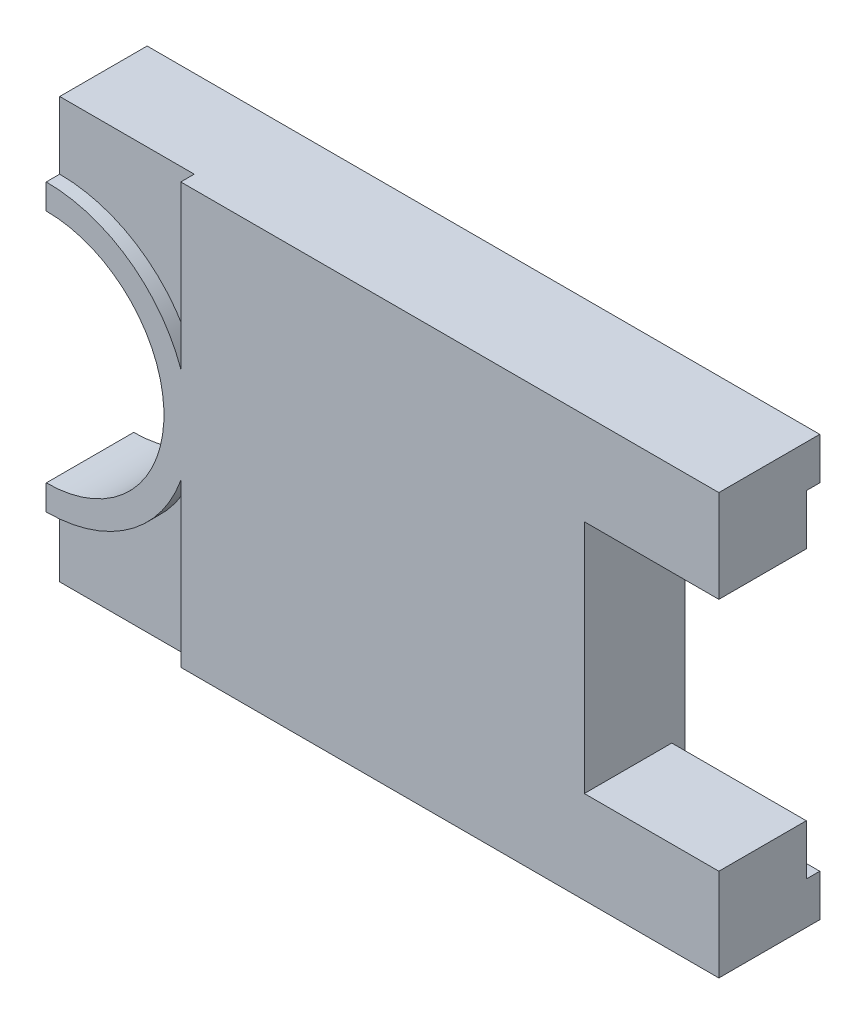
ISO-10303-21;
HEADER;
FILE_DESCRIPTION(('STEP AP214'),'2;1');
FILE_NAME('part.step','',(''),(''),'','','');
FILE_SCHEMA(('AUTOMOTIVE_DESIGN { 1 0 10303 214 1 1 1 1 }'));
ENDSEC;
DATA;
#1=APPLICATION_CONTEXT('core data for automotive mechanical design processes');
#2=APPLICATION_PROTOCOL_DEFINITION('international standard','automotive_design',2000,#1);
#3=PRODUCT_CONTEXT('',#1,'mechanical');
#4=PRODUCT('Part','Part','',(#3));
#5=PRODUCT_RELATED_PRODUCT_CATEGORY('part','',(#4));
#6=PRODUCT_DEFINITION_FORMATION('','',#4);
#7=PRODUCT_DEFINITION_CONTEXT('part definition',#1,'design');
#8=PRODUCT_DEFINITION('design','',#6,#7);
#9=PRODUCT_DEFINITION_SHAPE('','',#8);
#10=(LENGTH_UNIT() NAMED_UNIT(*) SI_UNIT(.MILLI.,.METRE.));
#11=(NAMED_UNIT(*) PLANE_ANGLE_UNIT() SI_UNIT($,.RADIAN.));
#12=(NAMED_UNIT(*) SI_UNIT($,.STERADIAN.) SOLID_ANGLE_UNIT());
#13=UNCERTAINTY_MEASURE_WITH_UNIT(LENGTH_MEASURE(1.E-05),#10,'distance_accuracy_value','');
#14=(GEOMETRIC_REPRESENTATION_CONTEXT(3) GLOBAL_UNCERTAINTY_ASSIGNED_CONTEXT((#13)) GLOBAL_UNIT_ASSIGNED_CONTEXT((#10,
#11,#12)) REPRESENTATION_CONTEXT('',''));
#15=CARTESIAN_POINT('',(0.,0.,0.));
#16=DIRECTION('',(0.,0.,1.));
#17=DIRECTION('',(1.,0.,0.));
#18=AXIS2_PLACEMENT_3D('',#15,#16,#17);
#19=CARTESIAN_POINT('',(-0.2,0.,0.04));
#20=DIRECTION('',(0.,0.,1.));
#21=DIRECTION('',(1.,0.,0.));
#22=AXIS2_PLACEMENT_3D('',#19,#20,#21);
#23=PLANE('',#22);
#24=DIRECTION('',(0.,-1.,0.));
#25=VECTOR('',#24,1.);
#26=CARTESIAN_POINT('',(0.2,-0.23094010767585,0.04));
#27=LINE('',#26,#25);
#28=CARTESIAN_POINT('',(0.2,-0.23094010767585,0.04));
#29=VERTEX_POINT('',#28);
#30=CARTESIAN_POINT('',(0.2,0.23094010767585,0.04));
#31=VERTEX_POINT('',#30);
#32=EDGE_CURVE('E160',#29,#31,#27,.F.);
#33=ORIENTED_EDGE('',*,*,#32,.F.);
#34=DIRECTION('',(-0.866025403784439,0.5,0.));
#35=VECTOR('',#34,1.);
#36=CARTESIAN_POINT('',(-0.2,0.,0.04));
#37=LINE('',#36,#35);
#38=CARTESIAN_POINT('',(-0.2,0.,0.04));
#39=VERTEX_POINT('',#38);
#40=EDGE_CURVE('E462',#39,#29,#37,.F.);
#41=ORIENTED_EDGE('',*,*,#40,.F.);
#42=DIRECTION('',(0.866025403784439,0.5,0.));
#43=VECTOR('',#42,1.);
#44=CARTESIAN_POINT('',(0.2,0.23094010767585,0.04));
#45=LINE('',#44,#43);
#46=EDGE_CURVE('E453',#31,#39,#45,.F.);
#47=ORIENTED_EDGE('',*,*,#46,.F.);
#48=EDGE_LOOP('',(#33,#41,#47));
#49=FACE_BOUND('',#48,.T.);
#50=ADVANCED_FACE('F16',(#49),#23,.F.);
#51=CARTESIAN_POINT('',(-1.,-0.625,0.3));
#52=DIRECTION('',(0.,1.,0.));
#53=DIRECTION('',(-1.,0.,0.));
#54=AXIS2_PLACEMENT_3D('',#51,#52,#53);
#55=PLANE('',#54);
#56=DIRECTION('',(-1.,0.,0.));
#57=VECTOR('',#56,1.);
#58=CARTESIAN_POINT('',(-1.,-0.625,0.26));
#59=LINE('',#58,#57);
#60=CARTESIAN_POINT('',(-1.,-0.625,0.26));
#61=VERTEX_POINT('',#60);
#62=CARTESIAN_POINT('',(-0.6,-0.625,0.26));
#63=VERTEX_POINT('',#62);
#64=EDGE_CURVE('E161',#61,#63,#59,.F.);
#65=ORIENTED_EDGE('',*,*,#64,.F.);
#66=DIRECTION('',(0.,0.,1.));
#67=VECTOR('',#66,1.);
#68=CARTESIAN_POINT('',(-1.,-0.625,0.3));
#69=LINE('',#68,#67);
#70=CARTESIAN_POINT('',(-1.,-0.625,0.));
#71=VERTEX_POINT('',#70);
#72=EDGE_CURVE('E177',#71,#61,#69,.T.);
#73=ORIENTED_EDGE('',*,*,#72,.F.);
#74=DIRECTION('',(1.,0.,0.));
#75=VECTOR('',#74,1.);
#76=CARTESIAN_POINT('',(-1.,-0.625,0.));
#77=LINE('',#76,#75);
#78=CARTESIAN_POINT('',(1.,-0.625,0.));
#79=VERTEX_POINT('',#78);
#80=EDGE_CURVE('E413',#71,#79,#77,.T.);
#81=ORIENTED_EDGE('',*,*,#80,.T.);
#82=DIRECTION('',(0.,0.,1.));
#83=VECTOR('',#82,1.);
#84=CARTESIAN_POINT('',(1.,-0.625,0.3));
#85=LINE('',#84,#83);
#86=CARTESIAN_POINT('',(1.,-0.625,0.3));
#87=VERTEX_POINT('',#86);
#88=EDGE_CURVE('E175',#87,#79,#85,.F.);
#89=ORIENTED_EDGE('',*,*,#88,.F.);
#90=DIRECTION('',(-1.,0.,0.));
#91=VECTOR('',#90,1.);
#92=CARTESIAN_POINT('',(-1.,-0.625,0.3));
#93=LINE('',#92,#91);
#94=CARTESIAN_POINT('',(-0.6,-0.625,0.3));
#95=VERTEX_POINT('',#94);
#96=EDGE_CURVE('E167',#95,#87,#93,.F.);
#97=ORIENTED_EDGE('',*,*,#96,.F.);
#98=DIRECTION('',(0.,0.,1.));
#99=VECTOR('',#98,1.);
#100=CARTESIAN_POINT('',(-0.6,-0.625,0.3));
#101=LINE('',#100,#99);
#102=EDGE_CURVE('E150',#63,#95,#101,.T.);
#103=ORIENTED_EDGE('',*,*,#102,.F.);
#104=EDGE_LOOP('',(#65,#73,#81,#89,#97,#103));
#105=FACE_BOUND('',#104,.T.);
#106=ADVANCED_FACE('F173',(#105),#55,.F.);
#107=CARTESIAN_POINT('',(0.2,-0.23094010767585,0.04));
#108=DIRECTION('',(-1.,0.,0.));
#109=DIRECTION('',(0.,-1.,0.));
#110=AXIS2_PLACEMENT_3D('',#107,#108,#109);
#111=PLANE('',#110);
#112=ORIENTED_EDGE('',*,*,#32,.T.);
#113=DIRECTION('',(0.,0.,1.));
#114=VECTOR('',#113,1.);
#115=CARTESIAN_POINT('',(0.2,0.23094010767585,0.04));
#116=LINE('',#115,#114);
#117=CARTESIAN_POINT('',(0.2,0.23094010767585,0.));
#118=VERTEX_POINT('',#117);
#119=EDGE_CURVE('E456',#118,#31,#116,.T.);
#120=ORIENTED_EDGE('',*,*,#119,.F.);
#121=DIRECTION('',(0.,1.,0.));
#122=VECTOR('',#121,1.);
#123=CARTESIAN_POINT('',(0.2,-0.625,0.));
#124=LINE('',#123,#122);
#125=CARTESIAN_POINT('',(0.2,-0.23094010767585,0.));
#126=VERTEX_POINT('',#125);
#127=EDGE_CURVE('E352',#118,#126,#124,.F.);
#128=ORIENTED_EDGE('',*,*,#127,.T.);
#129=DIRECTION('',(0.,0.,1.));
#130=VECTOR('',#129,1.);
#131=CARTESIAN_POINT('',(0.2,-0.23094010767585,0.04));
#132=LINE('',#131,#130);
#133=EDGE_CURVE('E459',#29,#126,#132,.F.);
#134=ORIENTED_EDGE('',*,*,#133,.F.);
#135=EDGE_LOOP('',(#112,#120,#128,#134));
#136=FACE_BOUND('',#135,.T.);
#137=ADVANCED_FACE('F512',(#136),#111,.T.);
#138=CARTESIAN_POINT('',(-0.2,0.,0.04));
#139=DIRECTION('',(0.5,0.866025403784439,0.));
#140=DIRECTION('',(-0.866025403784439,0.5,0.));
#141=AXIS2_PLACEMENT_3D('',#138,#139,#140);
#142=PLANE('',#141);
#143=ORIENTED_EDGE('',*,*,#40,.T.);
#144=ORIENTED_EDGE('',*,*,#133,.T.);
#145=DIRECTION('',(-0.866025403784439,0.499999999999999,0.));
#146=VECTOR('',#145,1.);
#147=CARTESIAN_POINT('',(0.2,-0.23094010767585,0.));
#148=LINE('',#147,#146);
#149=CARTESIAN_POINT('',(-0.2,0.,0.));
#150=VERTEX_POINT('',#149);
#151=EDGE_CURVE('E349',#126,#150,#148,.T.);
#152=ORIENTED_EDGE('',*,*,#151,.T.);
#153=DIRECTION('',(0.,0.,1.));
#154=VECTOR('',#153,1.);
#155=CARTESIAN_POINT('',(-0.2,0.,0.04));
#156=LINE('',#155,#154);
#157=EDGE_CURVE('E401',#39,#150,#156,.F.);
#158=ORIENTED_EDGE('',*,*,#157,.F.);
#159=EDGE_LOOP('',(#143,#144,#152,#158));
#160=FACE_BOUND('',#159,.T.);
#161=ADVANCED_FACE('F517',(#160),#142,.T.);
#162=CARTESIAN_POINT('',(0.2,0.23094010767585,0.04));
#163=DIRECTION('',(0.5,-0.866025403784439,0.));
#164=DIRECTION('',(0.866025403784439,0.5,0.));
#165=AXIS2_PLACEMENT_3D('',#162,#163,#164);
#166=PLANE('',#165);
#167=ORIENTED_EDGE('',*,*,#46,.T.);
#168=ORIENTED_EDGE('',*,*,#157,.T.);
#169=DIRECTION('',(0.866025403784439,0.499999999999999,0.));
#170=VECTOR('',#169,1.);
#171=CARTESIAN_POINT('',(-0.2,0.,0.));
#172=LINE('',#171,#170);
#173=EDGE_CURVE('E345',#150,#118,#172,.T.);
#174=ORIENTED_EDGE('',*,*,#173,.T.);
#175=ORIENTED_EDGE('',*,*,#119,.T.);
#176=EDGE_LOOP('',(#167,#168,#174,#175));
#177=FACE_BOUND('',#176,.T.);
#178=ADVANCED_FACE('F520',(#177),#166,.T.);
#179=CARTESIAN_POINT('',(-0.6,-0.35,2.37749868559375));
#180=DIRECTION('',(-1.,0.,0.));
#181=DIRECTION('',(0.,0.,1.));
#182=AXIS2_PLACEMENT_3D('',#179,#180,#181);
#183=PLANE('',#182);
#184=DIRECTION('',(0.,1.,0.));
#185=VECTOR('',#184,1.);
#186=CARTESIAN_POINT('',(-0.6,-0.625,0.));
#187=LINE('',#186,#185);
#188=CARTESIAN_POINT('',(-0.6,0.5,0.));
#189=VERTEX_POINT('',#188);
#190=CARTESIAN_POINT('',(-0.6,-0.5,0.));
#191=VERTEX_POINT('',#190);
#192=EDGE_CURVE('E358',#189,#191,#187,.F.);
#193=ORIENTED_EDGE('',*,*,#192,.T.);
#194=DIRECTION('',(0.,0.,1.));
#195=VECTOR('',#194,1.);
#196=CARTESIAN_POINT('',(-0.6,-0.5,0.04));
#197=LINE('',#196,#195);
#198=CARTESIAN_POINT('',(-0.6,-0.5,0.04));
#199=VERTEX_POINT('',#198);
#200=EDGE_CURVE('E296',#199,#191,#197,.F.);
#201=ORIENTED_EDGE('',*,*,#200,.F.);
#202=DIRECTION('',(0.,1.,0.));
#203=VECTOR('',#202,1.);
#204=CARTESIAN_POINT('',(-0.6,-0.5,0.04));
#205=LINE('',#204,#203);
#206=CARTESIAN_POINT('',(-0.6,0.5,0.04));
#207=VERTEX_POINT('',#206);
#208=EDGE_CURVE('E295',#199,#207,#205,.T.);
#209=ORIENTED_EDGE('',*,*,#208,.T.);
#210=DIRECTION('',(0.,0.,-1.));
#211=VECTOR('',#210,1.);
#212=CARTESIAN_POINT('',(-0.6,0.5,0.04));
#213=LINE('',#212,#211);
#214=EDGE_CURVE('E304',#189,#207,#213,.F.);
#215=ORIENTED_EDGE('',*,*,#214,.F.);
#216=EDGE_LOOP('',(#193,#201,#209,#215));
#217=FACE_BOUND('',#216,.T.);
#218=ADVANCED_FACE('F809',(#217),#183,.T.);
#219=CARTESIAN_POINT('',(1.,-0.5,0.04));
#220=DIRECTION('',(0.,-1.,0.));
#221=DIRECTION('',(0.,0.,-1.));
#222=AXIS2_PLACEMENT_3D('',#219,#220,#221);
#223=PLANE('',#222);
#224=DIRECTION('',(0.,0.,1.));
#225=VECTOR('',#224,1.);
#226=CARTESIAN_POINT('',(0.6,-0.5,2.37749868559375));
#227=LINE('',#226,#225);
#228=CARTESIAN_POINT('',(0.6,-0.5,0.));
#229=VERTEX_POINT('',#228);
#230=CARTESIAN_POINT('',(0.6,-0.5,0.0400000000000001));
#231=VERTEX_POINT('',#230);
#232=EDGE_CURVE('E392',#229,#231,#227,.T.);
#233=ORIENTED_EDGE('',*,*,#232,.T.);
#234=DIRECTION('',(-1.,0.,0.));
#235=VECTOR('',#234,1.);
#236=CARTESIAN_POINT('',(1.,-0.5,0.04));
#237=LINE('',#236,#235);
#238=CARTESIAN_POINT('',(1.,-0.5,0.04));
#239=VERTEX_POINT('',#238);
#240=EDGE_CURVE('E384',#239,#231,#237,.T.);
#241=ORIENTED_EDGE('',*,*,#240,.F.);
#242=DIRECTION('',(0.,0.,1.));
#243=VECTOR('',#242,1.);
#244=CARTESIAN_POINT('',(1.,-0.5,0.3));
#245=LINE('',#244,#243);
#246=CARTESIAN_POINT('',(1.,-0.5,0.));
#247=VERTEX_POINT('',#246);
#248=EDGE_CURVE('E419',#239,#247,#245,.F.);
#249=ORIENTED_EDGE('',*,*,#248,.T.);
#250=DIRECTION('',(1.,0.,0.));
#251=VECTOR('',#250,1.);
#252=CARTESIAN_POINT('',(-1.,-0.5,0.));
#253=LINE('',#252,#251);
#254=EDGE_CURVE('E355',#247,#229,#253,.F.);
#255=ORIENTED_EDGE('',*,*,#254,.T.);
#256=EDGE_LOOP('',(#233,#241,#249,#255));
#257=FACE_BOUND('',#256,.T.);
#258=ADVANCED_FACE('F801',(#257),#223,.F.);
#259=CARTESIAN_POINT('',(1.,-0.5,0.04));
#260=DIRECTION('',(0.,0.,-1.));
#261=DIRECTION('',(-1.,0.,0.));
#262=AXIS2_PLACEMENT_3D('',#259,#260,#261);
#263=PLANE('',#262);
#264=ORIENTED_EDGE('',*,*,#240,.T.);
#265=DIRECTION('',(0.,1.,0.));
#266=VECTOR('',#265,1.);
#267=CARTESIAN_POINT('',(0.6,-0.35,0.0400000000000001));
#268=LINE('',#267,#266);
#269=CARTESIAN_POINT('',(0.6,-0.35,0.0400000000000001));
#270=VERTEX_POINT('',#269);
#271=EDGE_CURVE('E264',#231,#270,#268,.T.);
#272=ORIENTED_EDGE('',*,*,#271,.T.);
#273=DIRECTION('',(1.,0.,0.));
#274=VECTOR('',#273,1.);
#275=CARTESIAN_POINT('',(1.,-0.35,0.0400000000000001));
#276=LINE('',#275,#274);
#277=CARTESIAN_POINT('',(1.,-0.35,0.0400000000000001));
#278=VERTEX_POINT('',#277);
#279=EDGE_CURVE('E274',#270,#278,#276,.T.);
#280=ORIENTED_EDGE('',*,*,#279,.T.);
#281=DIRECTION('',(0.,1.,0.));
#282=VECTOR('',#281,1.);
#283=CARTESIAN_POINT('',(1.,-0.625,0.04));
#284=LINE('',#283,#282);
#285=EDGE_CURVE('E416',#278,#239,#284,.F.);
#286=ORIENTED_EDGE('',*,*,#285,.T.);
#287=EDGE_LOOP('',(#264,#272,#280,#286));
#288=FACE_BOUND('',#287,.T.);
#289=ADVANCED_FACE('F540',(#288),#263,.T.);
#290=CARTESIAN_POINT('',(0.6,0.5,0.04));
#291=DIRECTION('',(0.,1.,0.));
#292=DIRECTION('',(0.,0.,1.));
#293=AXIS2_PLACEMENT_3D('',#290,#291,#292);
#294=PLANE('',#293);
#295=DIRECTION('',(0.,0.,1.));
#296=VECTOR('',#295,1.);
#297=CARTESIAN_POINT('',(1.,0.5,0.3));
#298=LINE('',#297,#296);
#299=CARTESIAN_POINT('',(1.,0.5,0.));
#300=VERTEX_POINT('',#299);
#301=CARTESIAN_POINT('',(1.,0.5,0.04));
#302=VERTEX_POINT('',#301);
#303=EDGE_CURVE('E342',#300,#302,#298,.T.);
#304=ORIENTED_EDGE('',*,*,#303,.T.);
#305=DIRECTION('',(-1.,0.,0.));
#306=VECTOR('',#305,1.);
#307=CARTESIAN_POINT('',(1.,0.5,0.04));
#308=LINE('',#307,#306);
#309=CARTESIAN_POINT('',(0.6,0.5,0.0400000000000001));
#310=VERTEX_POINT('',#309);
#311=EDGE_CURVE('E363',#310,#302,#308,.F.);
#312=ORIENTED_EDGE('',*,*,#311,.F.);
#313=DIRECTION('',(0.,0.,1.));
#314=VECTOR('',#313,1.);
#315=CARTESIAN_POINT('',(0.6,0.5,2.37749868559375));
#316=LINE('',#315,#314);
#317=CARTESIAN_POINT('',(0.6,0.5,0.));
#318=VERTEX_POINT('',#317);
#319=EDGE_CURVE('E379',#310,#318,#316,.F.);
#320=ORIENTED_EDGE('',*,*,#319,.T.);
#321=DIRECTION('',(1.,0.,0.));
#322=VECTOR('',#321,1.);
#323=CARTESIAN_POINT('',(-1.,0.5,0.));
#324=LINE('',#323,#322);
#325=EDGE_CURVE('E359',#318,#300,#324,.T.);
#326=ORIENTED_EDGE('',*,*,#325,.T.);
#327=EDGE_LOOP('',(#304,#312,#320,#326));
#328=FACE_BOUND('',#327,.T.);
#329=ADVANCED_FACE('F784',(#328),#294,.F.);
#330=CARTESIAN_POINT('',(1.,-0.5,0.04));
#331=DIRECTION('',(0.,0.,-1.));
#332=DIRECTION('',(-1.,0.,0.));
#333=AXIS2_PLACEMENT_3D('',#330,#331,#332);
#334=PLANE('',#333);
#335=ORIENTED_EDGE('',*,*,#311,.T.);
#336=DIRECTION('',(0.,1.,0.));
#337=VECTOR('',#336,1.);
#338=CARTESIAN_POINT('',(1.,-0.625,0.04));
#339=LINE('',#338,#337);
#340=CARTESIAN_POINT('',(1.,0.35,0.04));
#341=VERTEX_POINT('',#340);
#342=EDGE_CURVE('E324',#302,#341,#339,.F.);
#343=ORIENTED_EDGE('',*,*,#342,.T.);
#344=DIRECTION('',(-1.,0.,0.));
#345=VECTOR('',#344,1.);
#346=CARTESIAN_POINT('',(0.6,0.35,0.0400000000000001));
#347=LINE('',#346,#345);
#348=CARTESIAN_POINT('',(0.6,0.35,0.0400000000000001));
#349=VERTEX_POINT('',#348);
#350=EDGE_CURVE('E241',#341,#349,#347,.T.);
#351=ORIENTED_EDGE('',*,*,#350,.T.);
#352=DIRECTION('',(0.,1.,0.));
#353=VECTOR('',#352,1.);
#354=CARTESIAN_POINT('',(0.6,-0.35,0.0400000000000001));
#355=LINE('',#354,#353);
#356=EDGE_CURVE('E263',#349,#310,#355,.T.);
#357=ORIENTED_EDGE('',*,*,#356,.T.);
#358=EDGE_LOOP('',(#335,#343,#351,#357));
#359=FACE_BOUND('',#358,.T.);
#360=ADVANCED_FACE('F775',(#359),#334,.T.);
#361=CARTESIAN_POINT('',(-1.,-0.625,0.));
#362=DIRECTION('',(0.,0.,1.));
#363=DIRECTION('',(1.,0.,0.));
#364=AXIS2_PLACEMENT_3D('',#361,#362,#363);
#365=PLANE('',#364);
#366=ORIENTED_EDGE('',*,*,#151,.F.);
#367=ORIENTED_EDGE('',*,*,#127,.F.);
#368=ORIENTED_EDGE('',*,*,#173,.F.);
#369=EDGE_LOOP('',(#366,#367,#368));
#370=FACE_BOUND('',#369,.T.);
#371=ORIENTED_EDGE('',*,*,#254,.F.);
#372=DIRECTION('',(0.,1.,0.));
#373=VECTOR('',#372,1.);
#374=CARTESIAN_POINT('',(1.,-0.625,0.));
#375=LINE('',#374,#373);
#376=EDGE_CURVE('E275',#247,#79,#375,.F.);
#377=ORIENTED_EDGE('',*,*,#376,.T.);
#378=ORIENTED_EDGE('',*,*,#80,.F.);
#379=DIRECTION('',(0.,1.,0.));
#380=VECTOR('',#379,1.);
#381=CARTESIAN_POINT('',(-1.,-0.625,0.));
#382=LINE('',#381,#380);
#383=CARTESIAN_POINT('',(-1.,-0.5,0.));
#384=VERTEX_POINT('',#383);
#385=EDGE_CURVE('E83',#384,#71,#382,.F.);
#386=ORIENTED_EDGE('',*,*,#385,.F.);
#387=DIRECTION('',(-1.,0.,0.));
#388=VECTOR('',#387,1.);
#389=CARTESIAN_POINT('',(-1.,-0.5,0.));
#390=LINE('',#389,#388);
#391=EDGE_CURVE('E302',#191,#384,#390,.T.);
#392=ORIENTED_EDGE('',*,*,#391,.F.);
#393=ORIENTED_EDGE('',*,*,#192,.F.);
#394=DIRECTION('',(1.,0.,0.));
#395=VECTOR('',#394,1.);
#396=CARTESIAN_POINT('',(-0.6,0.5,0.));
#397=LINE('',#396,#395);
#398=CARTESIAN_POINT('',(-1.,0.5,0.));
#399=VERTEX_POINT('',#398);
#400=EDGE_CURVE('E348',#399,#189,#397,.T.);
#401=ORIENTED_EDGE('',*,*,#400,.F.);
#402=DIRECTION('',(0.,1.,0.));
#403=VECTOR('',#402,1.);
#404=CARTESIAN_POINT('',(-1.,-0.625,0.));
#405=LINE('',#404,#403);
#406=CARTESIAN_POINT('',(-1.,0.625,0.));
#407=VERTEX_POINT('',#406);
#408=EDGE_CURVE('E356',#407,#399,#405,.F.);
#409=ORIENTED_EDGE('',*,*,#408,.F.);
#410=DIRECTION('',(1.,0.,0.));
#411=VECTOR('',#410,1.);
#412=CARTESIAN_POINT('',(1.,0.625,0.));
#413=LINE('',#412,#411);
#414=CARTESIAN_POINT('',(1.,0.625,0.));
#415=VERTEX_POINT('',#414);
#416=EDGE_CURVE('E229',#407,#415,#413,.T.);
#417=ORIENTED_EDGE('',*,*,#416,.T.);
#418=DIRECTION('',(0.,1.,0.));
#419=VECTOR('',#418,1.);
#420=CARTESIAN_POINT('',(1.,-0.625,0.));
#421=LINE('',#420,#419);
#422=EDGE_CURVE('E240',#415,#300,#421,.F.);
#423=ORIENTED_EDGE('',*,*,#422,.T.);
#424=ORIENTED_EDGE('',*,*,#325,.F.);
#425=DIRECTION('',(0.,1.,0.));
#426=VECTOR('',#425,1.);
#427=CARTESIAN_POINT('',(0.6,-0.35,0.));
#428=LINE('',#427,#426);
#429=EDGE_CURVE('E252',#318,#229,#428,.F.);
#430=ORIENTED_EDGE('',*,*,#429,.T.);
#431=EDGE_LOOP('',(#371,#377,#378,#386,#392,#393,#401,#409,#417,#423,#424,#430));
#432=FACE_BOUND('',#431,.T.);
#433=ADVANCED_FACE('F484',(#370,#432),#365,.F.);
#434=CARTESIAN_POINT('',(-0.6,0.5,0.04));
#435=DIRECTION('',(0.,-1.,0.));
#436=DIRECTION('',(0.,0.,-1.));
#437=AXIS2_PLACEMENT_3D('',#434,#435,#436);
#438=PLANE('',#437);
#439=DIRECTION('',(1.,0.,0.));
#440=VECTOR('',#439,1.);
#441=CARTESIAN_POINT('',(-1.,0.5,0.04));
#442=LINE('',#441,#440);
#443=CARTESIAN_POINT('',(-1.,0.5,0.04));
#444=VERTEX_POINT('',#443);
#445=EDGE_CURVE('E327',#207,#444,#442,.F.);
#446=ORIENTED_EDGE('',*,*,#445,.T.);
#447=DIRECTION('',(0.,0.,-1.));
#448=VECTOR('',#447,1.);
#449=CARTESIAN_POINT('',(-1.,0.5,0.3));
#450=LINE('',#449,#448);
#451=EDGE_CURVE('E206',#444,#399,#450,.T.);
#452=ORIENTED_EDGE('',*,*,#451,.T.);
#453=ORIENTED_EDGE('',*,*,#400,.T.);
#454=ORIENTED_EDGE('',*,*,#214,.T.);
#455=EDGE_LOOP('',(#446,#452,#453,#454));
#456=FACE_BOUND('',#455,.T.);
#457=ADVANCED_FACE('F600',(#456),#438,.T.);
#458=CARTESIAN_POINT('',(-1.,0.,0.26));
#459=DIRECTION('',(0.,0.,-1.));
#460=DIRECTION('',(-1.,0.,0.));
#461=AXIS2_PLACEMENT_3D('',#458,#459,#460);
#462=PLANE('',#461);
#463=DIRECTION('',(1.,0.,0.));
#464=VECTOR('',#463,1.);
#465=CARTESIAN_POINT('',(1.,0.625,0.26));
#466=LINE('',#465,#464);
#467=CARTESIAN_POINT('',(-0.6,0.625,0.26));
#468=VERTEX_POINT('',#467);
#469=CARTESIAN_POINT('',(-1.,0.625,0.26));
#470=VERTEX_POINT('',#469);
#471=EDGE_CURVE('E228',#468,#470,#466,.F.);
#472=ORIENTED_EDGE('',*,*,#471,.T.);
#473=DIRECTION('',(0.,1.,0.));
#474=VECTOR('',#473,1.);
#475=CARTESIAN_POINT('',(-1.,0.625,0.26));
#476=LINE('',#475,#474);
#477=CARTESIAN_POINT('',(-1.,0.425,0.26));
#478=VERTEX_POINT('',#477);
#479=EDGE_CURVE('E309',#470,#478,#476,.F.);
#480=ORIENTED_EDGE('',*,*,#479,.T.);
#481=CARTESIAN_POINT('',(-1.,0.,0.26));
#482=DIRECTION('',(0.,0.,-1.));
#483=DIRECTION('',(-1.,0.,0.));
#484=AXIS2_PLACEMENT_3D('',#481,#482,#483);
#485=CIRCLE('',#484,0.425);
#486=CARTESIAN_POINT('',(-0.6,0.14361406616345,0.26));
#487=VERTEX_POINT('',#486);
#488=EDGE_CURVE('E197',#487,#478,#485,.F.);
#489=ORIENTED_EDGE('',*,*,#488,.F.);
#490=DIRECTION('',(0.,1.,0.));
#491=VECTOR('',#490,1.);
#492=CARTESIAN_POINT('',(-0.6,0.14361406616345,0.26));
#493=LINE('',#492,#491);
#494=EDGE_CURVE('E212',#487,#468,#493,.T.);
#495=ORIENTED_EDGE('',*,*,#494,.T.);
#496=EDGE_LOOP('',(#472,#480,#489,#495));
#497=FACE_BOUND('',#496,.T.);
#498=ADVANCED_FACE('F575',(#497),#462,.F.);
#499=CARTESIAN_POINT('',(-1.,0.,0.26));
#500=DIRECTION('',(0.,0.,1.));
#501=DIRECTION('',(1.,0.,0.));
#502=AXIS2_PLACEMENT_3D('',#499,#500,#501);
#503=PLANE('',#502);
#504=DIRECTION('',(0.,1.,0.));
#505=VECTOR('',#504,1.);
#506=CARTESIAN_POINT('',(-1.,0.625,0.26));
#507=LINE('',#506,#505);
#508=CARTESIAN_POINT('',(-1.,-0.425,0.26));
#509=VERTEX_POINT('',#508);
#510=EDGE_CURVE('E283',#509,#61,#507,.F.);
#511=ORIENTED_EDGE('',*,*,#510,.T.);
#512=ORIENTED_EDGE('',*,*,#64,.T.);
#513=DIRECTION('',(0.,-1.,0.));
#514=VECTOR('',#513,1.);
#515=CARTESIAN_POINT('',(-0.6,-0.14361406616345,0.26));
#516=LINE('',#515,#514);
#517=CARTESIAN_POINT('',(-0.6,-0.14361406616345,0.26));
#518=VERTEX_POINT('',#517);
#519=EDGE_CURVE('E156',#518,#63,#516,.T.);
#520=ORIENTED_EDGE('',*,*,#519,.F.);
#521=CARTESIAN_POINT('',(-1.,0.,0.26));
#522=DIRECTION('',(0.,0.,-1.));
#523=DIRECTION('',(-1.,0.,0.));
#524=AXIS2_PLACEMENT_3D('',#521,#522,#523);
#525=CIRCLE('',#524,0.425);
#526=EDGE_CURVE('E19',#509,#518,#525,.F.);
#527=ORIENTED_EDGE('',*,*,#526,.F.);
#528=EDGE_LOOP('',(#511,#512,#520,#527));
#529=FACE_BOUND('',#528,.T.);
#530=ADVANCED_FACE('F479',(#529),#503,.T.);
#531=CARTESIAN_POINT('',(-1.,-0.5,0.04));
#532=DIRECTION('',(0.,1.,0.));
#533=DIRECTION('',(-1.,0.,0.));
#534=AXIS2_PLACEMENT_3D('',#531,#532,#533);
#535=PLANE('',#534);
#536=DIRECTION('',(1.,0.,0.));
#537=VECTOR('',#536,1.);
#538=CARTESIAN_POINT('',(-1.,-0.5,0.04));
#539=LINE('',#538,#537);
#540=CARTESIAN_POINT('',(-1.,-0.5,0.04));
#541=VERTEX_POINT('',#540);
#542=EDGE_CURVE('E292',#541,#199,#539,.T.);
#543=ORIENTED_EDGE('',*,*,#542,.T.);
#544=ORIENTED_EDGE('',*,*,#200,.T.);
#545=ORIENTED_EDGE('',*,*,#391,.T.);
#546=DIRECTION('',(0.,0.,-1.));
#547=VECTOR('',#546,1.);
#548=CARTESIAN_POINT('',(-1.,-0.5,0.3));
#549=LINE('',#548,#547);
#550=EDGE_CURVE('E285',#384,#541,#549,.F.);
#551=ORIENTED_EDGE('',*,*,#550,.T.);
#552=EDGE_LOOP('',(#543,#544,#545,#551));
#553=FACE_BOUND('',#552,.T.);
#554=ADVANCED_FACE('F620',(#553),#535,.T.);
#555=CARTESIAN_POINT('',(-1.,-0.5,0.04));
#556=DIRECTION('',(0.,0.,1.));
#557=DIRECTION('',(1.,0.,0.));
#558=AXIS2_PLACEMENT_3D('',#555,#556,#557);
#559=PLANE('',#558);
#560=CARTESIAN_POINT('',(-1.,0.,0.04));
#561=DIRECTION('',(0.,0.,-1.));
#562=DIRECTION('',(-1.,0.,0.));
#563=AXIS2_PLACEMENT_3D('',#560,#561,#562);
#564=CIRCLE('',#563,0.35);
#565=CARTESIAN_POINT('',(-1.,-0.35,0.04));
#566=VERTEX_POINT('',#565);
#567=CARTESIAN_POINT('',(-1.,0.35,0.04));
#568=VERTEX_POINT('',#567);
#569=EDGE_CURVE('E194',#566,#568,#564,.F.);
#570=ORIENTED_EDGE('',*,*,#569,.T.);
#571=DIRECTION('',(0.,1.,0.));
#572=VECTOR('',#571,1.);
#573=CARTESIAN_POINT('',(-1.,0.625,0.04));
#574=LINE('',#573,#572);
#575=EDGE_CURVE('E199',#568,#444,#574,.T.);
#576=ORIENTED_EDGE('',*,*,#575,.T.);
#577=ORIENTED_EDGE('',*,*,#445,.F.);
#578=ORIENTED_EDGE('',*,*,#208,.F.);
#579=ORIENTED_EDGE('',*,*,#542,.F.);
#580=DIRECTION('',(0.,1.,0.));
#581=VECTOR('',#580,1.);
#582=CARTESIAN_POINT('',(-1.,0.625,0.04));
#583=LINE('',#582,#581);
#584=EDGE_CURVE('E288',#541,#566,#583,.T.);
#585=ORIENTED_EDGE('',*,*,#584,.T.);
#586=EDGE_LOOP('',(#570,#576,#577,#578,#579,#585));
#587=FACE_BOUND('',#586,.T.);
#588=ADVANCED_FACE('F604',(#587),#559,.F.);
#589=CARTESIAN_POINT('',(-1.,0.,0.26));
#590=DIRECTION('',(0.,0.,-1.));
#591=DIRECTION('',(-1.,0.,0.));
#592=AXIS2_PLACEMENT_3D('',#589,#590,#591);
#593=CYLINDRICAL_SURFACE('',#592,0.425);
#594=ORIENTED_EDGE('',*,*,#526,.T.);
#595=DIRECTION('',(0.,0.,1.));
#596=VECTOR('',#595,1.);
#597=CARTESIAN_POINT('',(-0.6,-0.14361406616345,0.26));
#598=LINE('',#597,#596);
#599=CARTESIAN_POINT('',(-0.6,-0.14361406616345,0.3));
#600=VERTEX_POINT('',#599);
#601=EDGE_CURVE('E281',#600,#518,#598,.F.);
#602=ORIENTED_EDGE('',*,*,#601,.F.);
#603=CARTESIAN_POINT('',(-1.,0.,0.3));
#604=DIRECTION('',(0.,0.,-1.));
#605=DIRECTION('',(-1.,0.,0.));
#606=AXIS2_PLACEMENT_3D('',#603,#604,#605);
#607=CIRCLE('',#606,0.425);
#608=CARTESIAN_POINT('',(-1.,-0.425,0.3));
#609=VERTEX_POINT('',#608);
#610=EDGE_CURVE('E169',#609,#600,#607,.F.);
#611=ORIENTED_EDGE('',*,*,#610,.F.);
#612=DIRECTION('',(0.,0.,-1.));
#613=VECTOR('',#612,1.);
#614=CARTESIAN_POINT('',(-1.,-0.425,0.3));
#615=LINE('',#614,#613);
#616=EDGE_CURVE('E193',#609,#509,#615,.T.);
#617=ORIENTED_EDGE('',*,*,#616,.T.);
#618=EDGE_LOOP('',(#594,#602,#611,#617));
#619=FACE_BOUND('',#618,.T.);
#620=ADVANCED_FACE('F611',(#619),#593,.T.);
#621=CARTESIAN_POINT('',(-0.6,-0.14361406616345,0.26));
#622=DIRECTION('',(-1.,0.,0.));
#623=DIRECTION('',(0.,-1.,0.));
#624=AXIS2_PLACEMENT_3D('',#621,#622,#623);
#625=PLANE('',#624);
#626=ORIENTED_EDGE('',*,*,#519,.T.);
#627=ORIENTED_EDGE('',*,*,#102,.T.);
#628=DIRECTION('',(0.,1.,0.));
#629=VECTOR('',#628,1.);
#630=CARTESIAN_POINT('',(-0.6,-0.625,0.3));
#631=LINE('',#630,#629);
#632=EDGE_CURVE('E154',#600,#95,#631,.F.);
#633=ORIENTED_EDGE('',*,*,#632,.F.);
#634=ORIENTED_EDGE('',*,*,#601,.T.);
#635=EDGE_LOOP('',(#626,#627,#633,#634));
#636=FACE_BOUND('',#635,.T.);
#637=ADVANCED_FACE('F152',(#636),#625,.T.);
#638=CARTESIAN_POINT('',(1.,-0.625,0.3));
#639=DIRECTION('',(-1.,0.,0.));
#640=DIRECTION('',(0.,0.,1.));
#641=AXIS2_PLACEMENT_3D('',#638,#639,#640);
#642=PLANE('',#641);
#643=ORIENTED_EDGE('',*,*,#248,.F.);
#644=ORIENTED_EDGE('',*,*,#285,.F.);
#645=DIRECTION('',(0.,0.,1.));
#646=VECTOR('',#645,1.);
#647=CARTESIAN_POINT('',(1.,-0.35,2.37749868559375));
#648=LINE('',#647,#646);
#649=CARTESIAN_POINT('',(1.,-0.35,0.3));
#650=VERTEX_POINT('',#649);
#651=EDGE_CURVE('E271',#278,#650,#648,.T.);
#652=ORIENTED_EDGE('',*,*,#651,.T.);
#653=DIRECTION('',(0.,1.,0.));
#654=VECTOR('',#653,1.);
#655=CARTESIAN_POINT('',(1.,-0.625,0.3));
#656=LINE('',#655,#654);
#657=EDGE_CURVE('E170',#87,#650,#656,.T.);
#658=ORIENTED_EDGE('',*,*,#657,.F.);
#659=ORIENTED_EDGE('',*,*,#88,.T.);
#660=ORIENTED_EDGE('',*,*,#376,.F.);
#661=EDGE_LOOP('',(#643,#644,#652,#658,#659,#660));
#662=FACE_BOUND('',#661,.T.);
#663=ADVANCED_FACE('F488',(#662),#642,.F.);
#664=CARTESIAN_POINT('',(1.,-0.35,2.37749868559375));
#665=DIRECTION('',(0.,-1.,0.));
#666=DIRECTION('',(1.,0.,0.));
#667=AXIS2_PLACEMENT_3D('',#664,#665,#666);
#668=PLANE('',#667);
#669=DIRECTION('',(0.,0.,1.));
#670=VECTOR('',#669,1.);
#671=CARTESIAN_POINT('',(0.6,-0.35,2.37749868559375));
#672=LINE('',#671,#670);
#673=CARTESIAN_POINT('',(0.6,-0.35,0.3));
#674=VERTEX_POINT('',#673);
#675=EDGE_CURVE('E260',#270,#674,#672,.T.);
#676=ORIENTED_EDGE('',*,*,#675,.T.);
#677=DIRECTION('',(1.,0.,0.));
#678=VECTOR('',#677,1.);
#679=CARTESIAN_POINT('',(-1.,-0.35,0.3));
#680=LINE('',#679,#678);
#681=EDGE_CURVE('E257',#650,#674,#680,.F.);
#682=ORIENTED_EDGE('',*,*,#681,.F.);
#683=ORIENTED_EDGE('',*,*,#651,.F.);
#684=ORIENTED_EDGE('',*,*,#279,.F.);
#685=EDGE_LOOP('',(#676,#682,#683,#684));
#686=FACE_BOUND('',#685,.T.);
#687=ADVANCED_FACE('F546',(#686),#668,.F.);
#688=CARTESIAN_POINT('',(0.6,-0.35,2.37749868559375));
#689=DIRECTION('',(-1.,0.,0.));
#690=DIRECTION('',(0.,0.,1.));
#691=AXIS2_PLACEMENT_3D('',#688,#689,#690);
#692=PLANE('',#691);
#693=ORIENTED_EDGE('',*,*,#319,.F.);
#694=ORIENTED_EDGE('',*,*,#356,.F.);
#695=DIRECTION('',(0.,0.,1.));
#696=VECTOR('',#695,1.);
#697=CARTESIAN_POINT('',(0.6,0.35,2.37749868559375));
#698=LINE('',#697,#696);
#699=CARTESIAN_POINT('',(0.6,0.35,0.3));
#700=VERTEX_POINT('',#699);
#701=EDGE_CURVE('E249',#349,#700,#698,.T.);
#702=ORIENTED_EDGE('',*,*,#701,.T.);
#703=DIRECTION('',(0.,1.,0.));
#704=VECTOR('',#703,1.);
#705=CARTESIAN_POINT('',(0.6,-0.625,0.3));
#706=LINE('',#705,#704);
#707=EDGE_CURVE('E246',#674,#700,#706,.T.);
#708=ORIENTED_EDGE('',*,*,#707,.F.);
#709=ORIENTED_EDGE('',*,*,#675,.F.);
#710=ORIENTED_EDGE('',*,*,#271,.F.);
#711=ORIENTED_EDGE('',*,*,#232,.F.);
#712=ORIENTED_EDGE('',*,*,#429,.F.);
#713=EDGE_LOOP('',(#693,#694,#702,#708,#709,#710,#711,#712));
#714=FACE_BOUND('',#713,.T.);
#715=ADVANCED_FACE('F550',(#714),#692,.F.);
#716=CARTESIAN_POINT('',(0.6,0.35,2.37749868559375));
#717=DIRECTION('',(0.,1.,0.));
#718=DIRECTION('',(-1.,0.,0.));
#719=AXIS2_PLACEMENT_3D('',#716,#717,#718);
#720=PLANE('',#719);
#721=DIRECTION('',(0.,0.,1.));
#722=VECTOR('',#721,1.);
#723=CARTESIAN_POINT('',(1.,0.35,0.3));
#724=LINE('',#723,#722);
#725=CARTESIAN_POINT('',(1.,0.35,0.3));
#726=VERTEX_POINT('',#725);
#727=EDGE_CURVE('E237',#341,#726,#724,.T.);
#728=ORIENTED_EDGE('',*,*,#727,.T.);
#729=DIRECTION('',(1.,0.,0.));
#730=VECTOR('',#729,1.);
#731=CARTESIAN_POINT('',(-1.,0.35,0.3));
#732=LINE('',#731,#730);
#733=EDGE_CURVE('E234',#700,#726,#732,.T.);
#734=ORIENTED_EDGE('',*,*,#733,.F.);
#735=ORIENTED_EDGE('',*,*,#701,.F.);
#736=ORIENTED_EDGE('',*,*,#350,.F.);
#737=EDGE_LOOP('',(#728,#734,#735,#736));
#738=FACE_BOUND('',#737,.T.);
#739=ADVANCED_FACE('F555',(#738),#720,.F.);
#740=CARTESIAN_POINT('',(1.,-0.625,0.3));
#741=DIRECTION('',(-1.,0.,0.));
#742=DIRECTION('',(0.,0.,1.));
#743=AXIS2_PLACEMENT_3D('',#740,#741,#742);
#744=PLANE('',#743);
#745=ORIENTED_EDGE('',*,*,#303,.F.);
#746=ORIENTED_EDGE('',*,*,#422,.F.);
#747=DIRECTION('',(0.,0.,1.));
#748=VECTOR('',#747,1.);
#749=CARTESIAN_POINT('',(1.,0.625,0.3));
#750=LINE('',#749,#748);
#751=CARTESIAN_POINT('',(1.,0.625,0.3));
#752=VERTEX_POINT('',#751);
#753=EDGE_CURVE('E225',#415,#752,#750,.T.);
#754=ORIENTED_EDGE('',*,*,#753,.T.);
#755=DIRECTION('',(0.,1.,0.));
#756=VECTOR('',#755,1.);
#757=CARTESIAN_POINT('',(1.,-0.625,0.3));
#758=LINE('',#757,#756);
#759=EDGE_CURVE('E222',#726,#752,#758,.T.);
#760=ORIENTED_EDGE('',*,*,#759,.F.);
#761=ORIENTED_EDGE('',*,*,#727,.F.);
#762=ORIENTED_EDGE('',*,*,#342,.F.);
#763=EDGE_LOOP('',(#745,#746,#754,#760,#761,#762));
#764=FACE_BOUND('',#763,.T.);
#765=ADVANCED_FACE('F560',(#764),#744,.F.);
#766=CARTESIAN_POINT('',(1.,0.625,0.3));
#767=DIRECTION('',(0.,-1.,0.));
#768=DIRECTION('',(1.,0.,0.));
#769=AXIS2_PLACEMENT_3D('',#766,#767,#768);
#770=PLANE('',#769);
#771=DIRECTION('',(0.,0.,1.));
#772=VECTOR('',#771,1.);
#773=CARTESIAN_POINT('',(-0.6,0.625,0.26));
#774=LINE('',#773,#772);
#775=CARTESIAN_POINT('',(-0.6,0.625,0.3));
#776=VERTEX_POINT('',#775);
#777=EDGE_CURVE('E208',#468,#776,#774,.T.);
#778=ORIENTED_EDGE('',*,*,#777,.T.);
#779=DIRECTION('',(1.,0.,0.));
#780=VECTOR('',#779,1.);
#781=CARTESIAN_POINT('',(-1.,0.625,0.3));
#782=LINE('',#781,#780);
#783=EDGE_CURVE('E219',#752,#776,#782,.F.);
#784=ORIENTED_EDGE('',*,*,#783,.F.);
#785=ORIENTED_EDGE('',*,*,#753,.F.);
#786=ORIENTED_EDGE('',*,*,#416,.F.);
#787=DIRECTION('',(0.,0.,-1.));
#788=VECTOR('',#787,1.);
#789=CARTESIAN_POINT('',(-1.,0.625,0.3));
#790=LINE('',#789,#788);
#791=EDGE_CURVE('E311',#407,#470,#790,.F.);
#792=ORIENTED_EDGE('',*,*,#791,.T.);
#793=ORIENTED_EDGE('',*,*,#471,.F.);
#794=EDGE_LOOP('',(#778,#784,#785,#786,#792,#793));
#795=FACE_BOUND('',#794,.T.);
#796=ADVANCED_FACE('F566',(#795),#770,.F.);
#797=CARTESIAN_POINT('',(-0.6,0.14361406616345,0.26));
#798=DIRECTION('',(1.,0.,0.));
#799=DIRECTION('',(0.,1.,0.));
#800=AXIS2_PLACEMENT_3D('',#797,#798,#799);
#801=PLANE('',#800);
#802=ORIENTED_EDGE('',*,*,#777,.F.);
#803=ORIENTED_EDGE('',*,*,#494,.F.);
#804=DIRECTION('',(0.,0.,-1.));
#805=VECTOR('',#804,1.);
#806=CARTESIAN_POINT('',(-0.6,0.14361406616345,0.26));
#807=LINE('',#806,#805);
#808=CARTESIAN_POINT('',(-0.6,0.14361406616345,0.3));
#809=VERTEX_POINT('',#808);
#810=EDGE_CURVE('E200',#809,#487,#807,.T.);
#811=ORIENTED_EDGE('',*,*,#810,.F.);
#812=DIRECTION('',(0.,1.,0.));
#813=VECTOR('',#812,1.);
#814=CARTESIAN_POINT('',(-0.6,-0.625,0.3));
#815=LINE('',#814,#813);
#816=EDGE_CURVE('E191',#776,#809,#815,.F.);
#817=ORIENTED_EDGE('',*,*,#816,.F.);
#818=EDGE_LOOP('',(#802,#803,#811,#817));
#819=FACE_BOUND('',#818,.T.);
#820=ADVANCED_FACE('F579',(#819),#801,.F.);
#821=CARTESIAN_POINT('',(-1.,0.,0.26));
#822=DIRECTION('',(0.,0.,-1.));
#823=DIRECTION('',(-1.,0.,0.));
#824=AXIS2_PLACEMENT_3D('',#821,#822,#823);
#825=CYLINDRICAL_SURFACE('',#824,0.425);
#826=ORIENTED_EDGE('',*,*,#488,.T.);
#827=DIRECTION('',(0.,0.,-1.));
#828=VECTOR('',#827,1.);
#829=CARTESIAN_POINT('',(-1.,0.425,0.3));
#830=LINE('',#829,#828);
#831=CARTESIAN_POINT('',(-1.,0.425,0.3));
#832=VERTEX_POINT('',#831);
#833=EDGE_CURVE('E196',#478,#832,#830,.F.);
#834=ORIENTED_EDGE('',*,*,#833,.T.);
#835=CARTESIAN_POINT('',(-1.,0.,0.3));
#836=DIRECTION('',(0.,0.,-1.));
#837=DIRECTION('',(-1.,0.,0.));
#838=AXIS2_PLACEMENT_3D('',#835,#836,#837);
#839=CIRCLE('',#838,0.425);
#840=EDGE_CURVE('E188',#809,#832,#839,.F.);
#841=ORIENTED_EDGE('',*,*,#840,.F.);
#842=ORIENTED_EDGE('',*,*,#810,.T.);
#843=EDGE_LOOP('',(#826,#834,#841,#842));
#844=FACE_BOUND('',#843,.T.);
#845=ADVANCED_FACE('F596',(#844),#825,.T.);
#846=CARTESIAN_POINT('',(-1.,0.625,0.3));
#847=DIRECTION('',(1.,0.,0.));
#848=DIRECTION('',(0.,0.,-1.));
#849=AXIS2_PLACEMENT_3D('',#846,#847,#848);
#850=PLANE('',#849);
#851=ORIENTED_EDGE('',*,*,#833,.F.);
#852=ORIENTED_EDGE('',*,*,#479,.F.);
#853=ORIENTED_EDGE('',*,*,#791,.F.);
#854=ORIENTED_EDGE('',*,*,#408,.T.);
#855=ORIENTED_EDGE('',*,*,#451,.F.);
#856=ORIENTED_EDGE('',*,*,#575,.F.);
#857=DIRECTION('',(0.,0.,-1.));
#858=VECTOR('',#857,1.);
#859=CARTESIAN_POINT('',(-1.,0.35,0.04));
#860=LINE('',#859,#858);
#861=CARTESIAN_POINT('',(-1.,0.35,0.3));
#862=VERTEX_POINT('',#861);
#863=EDGE_CURVE('E195',#568,#862,#860,.F.);
#864=ORIENTED_EDGE('',*,*,#863,.T.);
#865=DIRECTION('',(0.,1.,0.));
#866=VECTOR('',#865,1.);
#867=CARTESIAN_POINT('',(-1.,-0.625,0.3));
#868=LINE('',#867,#866);
#869=EDGE_CURVE('E187',#832,#862,#868,.F.);
#870=ORIENTED_EDGE('',*,*,#869,.F.);
#871=EDGE_LOOP('',(#851,#852,#853,#854,#855,#856,#864,#870));
#872=FACE_BOUND('',#871,.T.);
#873=ADVANCED_FACE('F592',(#872),#850,.F.);
#874=CARTESIAN_POINT('',(-1.,0.,0.04));
#875=DIRECTION('',(0.,0.,-1.));
#876=DIRECTION('',(-1.,0.,0.));
#877=AXIS2_PLACEMENT_3D('',#874,#875,#876);
#878=CYLINDRICAL_SURFACE('',#877,0.35);
#879=ORIENTED_EDGE('',*,*,#863,.F.);
#880=ORIENTED_EDGE('',*,*,#569,.F.);
#881=DIRECTION('',(0.,0.,-1.));
#882=VECTOR('',#881,1.);
#883=CARTESIAN_POINT('',(-1.,-0.35,0.3));
#884=LINE('',#883,#882);
#885=CARTESIAN_POINT('',(-1.,-0.35,0.3));
#886=VERTEX_POINT('',#885);
#887=EDGE_CURVE('E34',#566,#886,#884,.F.);
#888=ORIENTED_EDGE('',*,*,#887,.T.);
#889=CARTESIAN_POINT('',(-1.,0.,0.3));
#890=DIRECTION('',(0.,0.,-1.));
#891=DIRECTION('',(-1.,0.,0.));
#892=AXIS2_PLACEMENT_3D('',#889,#890,#891);
#893=CIRCLE('',#892,0.35);
#894=EDGE_CURVE('E25',#862,#886,#893,.T.);
#895=ORIENTED_EDGE('',*,*,#894,.F.);
#896=EDGE_LOOP('',(#879,#880,#888,#895));
#897=FACE_BOUND('',#896,.T.);
#898=ADVANCED_FACE('F595',(#897),#878,.F.);
#899=CARTESIAN_POINT('',(-1.,0.625,0.3));
#900=DIRECTION('',(1.,0.,0.));
#901=DIRECTION('',(0.,0.,-1.));
#902=AXIS2_PLACEMENT_3D('',#899,#900,#901);
#903=PLANE('',#902);
#904=DIRECTION('',(0.,1.,0.));
#905=VECTOR('',#904,1.);
#906=CARTESIAN_POINT('',(-1.,-0.625,0.3));
#907=LINE('',#906,#905);
#908=EDGE_CURVE('E11',#886,#609,#907,.F.);
#909=ORIENTED_EDGE('',*,*,#908,.F.);
#910=ORIENTED_EDGE('',*,*,#887,.F.);
#911=ORIENTED_EDGE('',*,*,#584,.F.);
#912=ORIENTED_EDGE('',*,*,#550,.F.);
#913=ORIENTED_EDGE('',*,*,#385,.T.);
#914=ORIENTED_EDGE('',*,*,#72,.T.);
#915=ORIENTED_EDGE('',*,*,#510,.F.);
#916=ORIENTED_EDGE('',*,*,#616,.F.);
#917=EDGE_LOOP('',(#909,#910,#911,#912,#913,#914,#915,#916));
#918=FACE_BOUND('',#917,.T.);
#919=ADVANCED_FACE('F607',(#918),#903,.F.);
#920=CARTESIAN_POINT('',(-1.,-0.625,0.3));
#921=DIRECTION('',(0.,0.,1.));
#922=DIRECTION('',(1.,0.,0.));
#923=AXIS2_PLACEMENT_3D('',#920,#921,#922);
#924=PLANE('',#923);
#925=ORIENTED_EDGE('',*,*,#894,.T.);
#926=ORIENTED_EDGE('',*,*,#908,.T.);
#927=ORIENTED_EDGE('',*,*,#610,.T.);
#928=ORIENTED_EDGE('',*,*,#632,.T.);
#929=ORIENTED_EDGE('',*,*,#96,.T.);
#930=ORIENTED_EDGE('',*,*,#657,.T.);
#931=ORIENTED_EDGE('',*,*,#681,.T.);
#932=ORIENTED_EDGE('',*,*,#707,.T.);
#933=ORIENTED_EDGE('',*,*,#733,.T.);
#934=ORIENTED_EDGE('',*,*,#759,.T.);
#935=ORIENTED_EDGE('',*,*,#783,.T.);
#936=ORIENTED_EDGE('',*,*,#816,.T.);
#937=ORIENTED_EDGE('',*,*,#840,.T.);
#938=ORIENTED_EDGE('',*,*,#869,.T.);
#939=EDGE_LOOP('',(#925,#926,#927,#928,#929,#930,#931,#932,#933,#934,#935,#936,#937,#938));
#940=FACE_BOUND('',#939,.T.);
#941=ADVANCED_FACE('F165',(#940),#924,.T.);
#942=CLOSED_SHELL('',(#50,#106,#137,#161,#178,#218,#258,#289,#329,#360,#433,#457,#498,#530,#554,
#588,#620,#637,#663,#687,#715,#739,#765,#796,#820,#845,#873,#898,#919,#941));
#943=MANIFOLD_SOLID_BREP('B1',#942);
#944=ADVANCED_BREP_SHAPE_REPRESENTATION('',(#18,#943),#14);
#945=SHAPE_DEFINITION_REPRESENTATION(#9,#944);
ENDSEC;
END-ISO-10303-21;
